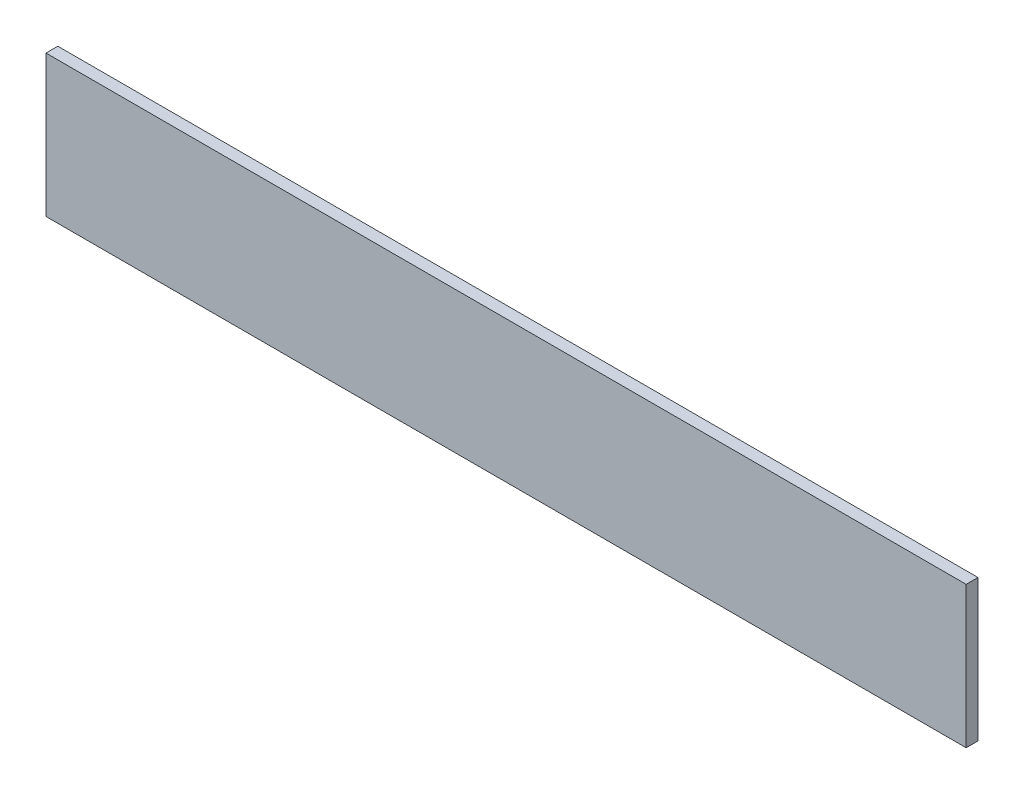
ISO-10303-21;
HEADER;
FILE_DESCRIPTION(('STEP AP214'),'2;1');
FILE_NAME('part.step','',(''),(''),'','','');
FILE_SCHEMA(('AUTOMOTIVE_DESIGN { 1 0 10303 214 1 1 1 1 }'));
ENDSEC;
DATA;
#1=APPLICATION_CONTEXT('core data for automotive mechanical design processes');
#2=APPLICATION_PROTOCOL_DEFINITION('international standard','automotive_design',2000,#1);
#3=PRODUCT_CONTEXT('',#1,'mechanical');
#4=PRODUCT('Part','Part','',(#3));
#5=PRODUCT_RELATED_PRODUCT_CATEGORY('part','',(#4));
#6=PRODUCT_DEFINITION_FORMATION('','',#4);
#7=PRODUCT_DEFINITION_CONTEXT('part definition',#1,'design');
#8=PRODUCT_DEFINITION('design','',#6,#7);
#9=PRODUCT_DEFINITION_SHAPE('','',#8);
#10=(LENGTH_UNIT() NAMED_UNIT(*) SI_UNIT(.MILLI.,.METRE.));
#11=(NAMED_UNIT(*) PLANE_ANGLE_UNIT() SI_UNIT($,.RADIAN.));
#12=(NAMED_UNIT(*) SI_UNIT($,.STERADIAN.) SOLID_ANGLE_UNIT());
#13=UNCERTAINTY_MEASURE_WITH_UNIT(LENGTH_MEASURE(1.E-05),#10,'distance_accuracy_value','');
#14=(GEOMETRIC_REPRESENTATION_CONTEXT(3) GLOBAL_UNCERTAINTY_ASSIGNED_CONTEXT((#13)) GLOBAL_UNIT_ASSIGNED_CONTEXT((#10,
#11,#12)) REPRESENTATION_CONTEXT('',''));
#15=CARTESIAN_POINT('',(0.,0.,0.));
#16=DIRECTION('',(0.,0.,1.));
#17=DIRECTION('',(1.,0.,0.));
#18=AXIS2_PLACEMENT_3D('',#15,#16,#17);
#19=CARTESIAN_POINT('',(1.1006089778178,1.5391048737361,1.7496000059366));
#20=DIRECTION('',(0.,1.,0.));
#21=DIRECTION('',(0.,0.,1.));
#22=AXIS2_PLACEMENT_3D('',#19,#20,#21);
#23=PLANE('',#22);
#24=DIRECTION('',(0.,0.,1.));
#25=VECTOR('',#24,1.);
#26=CARTESIAN_POINT('',(1.0850641795163,1.5391048737361,1.7492000059366));
#27=LINE('',#26,#25);
#28=CARTESIAN_POINT('',(1.0850641795163,1.5391048737361,1.7492000059366));
#29=VERTEX_POINT('',#28);
#30=CARTESIAN_POINT('',(1.0850641795163,1.5391048737361,1.7496000059366));
#31=VERTEX_POINT('',#30);
#32=EDGE_CURVE('E11',#29,#31,#27,.T.);
#33=ORIENTED_EDGE('',*,*,#32,.T.);
#34=DIRECTION('',(1.,0.,0.));
#35=VECTOR('',#34,1.);
#36=CARTESIAN_POINT('',(1.0850641795163,1.5391048737361,1.7496000059366));
#37=LINE('',#36,#35);
#38=CARTESIAN_POINT('',(1.1161537761193,1.5391048737361,1.7496000059366));
#39=VERTEX_POINT('',#38);
#40=EDGE_CURVE('E24',#31,#39,#37,.T.);
#41=ORIENTED_EDGE('',*,*,#40,.T.);
#42=DIRECTION('',(0.,0.,1.));
#43=VECTOR('',#42,1.);
#44=CARTESIAN_POINT('',(1.1161537761193,1.5391048737361,1.7492000059366));
#45=LINE('',#44,#43);
#46=CARTESIAN_POINT('',(1.1161537761193,1.5391048737361,1.7492000059366));
#47=VERTEX_POINT('',#46);
#48=EDGE_CURVE('E85',#47,#39,#45,.T.);
#49=ORIENTED_EDGE('',*,*,#48,.F.);
#50=DIRECTION('',(1.,0.,0.));
#51=VECTOR('',#50,1.);
#52=CARTESIAN_POINT('',(1.0850641795163,1.5391048737361,1.7492000059366));
#53=LINE('',#52,#51);
#54=EDGE_CURVE('E83',#29,#47,#53,.T.);
#55=ORIENTED_EDGE('',*,*,#54,.F.);
#56=EDGE_LOOP('',(#33,#41,#49,#55));
#57=FACE_BOUND('',#56,.T.);
#58=ADVANCED_FACE('F17',(#57),#23,.T.);
#59=CARTESIAN_POINT('',(1.1161537761193,1.5367133663051,1.7496000059366));
#60=DIRECTION('',(1.,0.,0.));
#61=DIRECTION('',(0.,0.,-1.));
#62=AXIS2_PLACEMENT_3D('',#59,#60,#61);
#63=PLANE('',#62);
#64=ORIENTED_EDGE('',*,*,#48,.T.);
#65=DIRECTION('',(0.,-1.,0.));
#66=VECTOR('',#65,1.);
#67=CARTESIAN_POINT('',(1.1161537761193,1.5391048737361,1.7496000059366));
#68=LINE('',#67,#66);
#69=CARTESIAN_POINT('',(1.1161537761193,1.5343218588741,1.7496000059366));
#70=VERTEX_POINT('',#69);
#71=EDGE_CURVE('E81',#39,#70,#68,.T.);
#72=ORIENTED_EDGE('',*,*,#71,.T.);
#73=DIRECTION('',(0.,0.,1.));
#74=VECTOR('',#73,1.);
#75=CARTESIAN_POINT('',(1.1161537761193,1.5343218588741,1.7492000059366));
#76=LINE('',#75,#74);
#77=CARTESIAN_POINT('',(1.1161537761193,1.5343218588741,1.7492000059366));
#78=VERTEX_POINT('',#77);
#79=EDGE_CURVE('E79',#78,#70,#76,.T.);
#80=ORIENTED_EDGE('',*,*,#79,.F.);
#81=DIRECTION('',(0.,-1.,0.));
#82=VECTOR('',#81,1.);
#83=CARTESIAN_POINT('',(1.1161537761193,1.5391048737361,1.7492000059366));
#84=LINE('',#83,#82);
#85=EDGE_CURVE('E70',#47,#78,#84,.T.);
#86=ORIENTED_EDGE('',*,*,#85,.F.);
#87=EDGE_LOOP('',(#64,#72,#80,#86));
#88=FACE_BOUND('',#87,.T.);
#89=ADVANCED_FACE('F90',(#88),#63,.T.);
#90=CARTESIAN_POINT('',(1.1006089778178,1.5343218588741,1.7496000059366));
#91=DIRECTION('',(0.,-1.,0.));
#92=DIRECTION('',(0.,0.,-1.));
#93=AXIS2_PLACEMENT_3D('',#90,#91,#92);
#94=PLANE('',#93);
#95=ORIENTED_EDGE('',*,*,#79,.T.);
#96=DIRECTION('',(-1.,0.,0.));
#97=VECTOR('',#96,1.);
#98=CARTESIAN_POINT('',(1.1161537761193,1.5343218588741,1.7496000059366));
#99=LINE('',#98,#97);
#100=CARTESIAN_POINT('',(1.0850641795163,1.5343218588741,1.7496000059366));
#101=VERTEX_POINT('',#100);
#102=EDGE_CURVE('E60',#70,#101,#99,.T.);
#103=ORIENTED_EDGE('',*,*,#102,.T.);
#104=DIRECTION('',(0.,0.,1.));
#105=VECTOR('',#104,1.);
#106=CARTESIAN_POINT('',(1.0850641795163,1.5343218588741,1.7492000059366));
#107=LINE('',#106,#105);
#108=CARTESIAN_POINT('',(1.0850641795163,1.5343218588741,1.7492000059366));
#109=VERTEX_POINT('',#108);
#110=EDGE_CURVE('E54',#109,#101,#107,.T.);
#111=ORIENTED_EDGE('',*,*,#110,.F.);
#112=DIRECTION('',(-1.,0.,0.));
#113=VECTOR('',#112,1.);
#114=CARTESIAN_POINT('',(1.1161537761193,1.5343218588741,1.7492000059366));
#115=LINE('',#114,#113);
#116=EDGE_CURVE('E58',#78,#109,#115,.T.);
#117=ORIENTED_EDGE('',*,*,#116,.F.);
#118=EDGE_LOOP('',(#95,#103,#111,#117));
#119=FACE_BOUND('',#118,.T.);
#120=ADVANCED_FACE('F57',(#119),#94,.T.);
#121=CARTESIAN_POINT('',(1.0850641795163,1.5367133663051,1.7496000059366));
#122=DIRECTION('',(-1.,0.,0.));
#123=DIRECTION('',(0.,0.,1.));
#124=AXIS2_PLACEMENT_3D('',#121,#122,#123);
#125=PLANE('',#124);
#126=ORIENTED_EDGE('',*,*,#110,.T.);
#127=DIRECTION('',(0.,1.,0.));
#128=VECTOR('',#127,1.);
#129=CARTESIAN_POINT('',(1.0850641795163,1.5343218588741,1.7496000059366));
#130=LINE('',#129,#128);
#131=EDGE_CURVE('E71',#101,#31,#130,.T.);
#132=ORIENTED_EDGE('',*,*,#131,.T.);
#133=ORIENTED_EDGE('',*,*,#32,.F.);
#134=DIRECTION('',(0.,1.,0.));
#135=VECTOR('',#134,1.);
#136=CARTESIAN_POINT('',(1.0850641795163,1.5343218588741,1.7492000059366));
#137=LINE('',#136,#135);
#138=EDGE_CURVE('E68',#109,#29,#137,.T.);
#139=ORIENTED_EDGE('',*,*,#138,.F.);
#140=EDGE_LOOP('',(#126,#132,#133,#139));
#141=FACE_BOUND('',#140,.T.);
#142=ADVANCED_FACE('F73',(#141),#125,.T.);
#143=CARTESIAN_POINT('',(1.0850641795163,1.5367133663051,1.7492000059366));
#144=DIRECTION('',(0.,0.,-1.));
#145=DIRECTION('',(-1.,0.,0.));
#146=AXIS2_PLACEMENT_3D('',#143,#144,#145);
#147=PLANE('',#146);
#148=ORIENTED_EDGE('',*,*,#54,.T.);
#149=ORIENTED_EDGE('',*,*,#85,.T.);
#150=ORIENTED_EDGE('',*,*,#116,.T.);
#151=ORIENTED_EDGE('',*,*,#138,.T.);
#152=EDGE_LOOP('',(#148,#149,#150,#151));
#153=FACE_BOUND('',#152,.T.);
#154=ADVANCED_FACE('F67',(#153),#147,.T.);
#155=CARTESIAN_POINT('',(1.0850641795163,1.5367133663051,1.7496000059366));
#156=DIRECTION('',(0.,0.,-1.));
#157=DIRECTION('',(-1.,0.,0.));
#158=AXIS2_PLACEMENT_3D('',#155,#156,#157);
#159=PLANE('',#158);
#160=ORIENTED_EDGE('',*,*,#40,.F.);
#161=ORIENTED_EDGE('',*,*,#131,.F.);
#162=ORIENTED_EDGE('',*,*,#102,.F.);
#163=ORIENTED_EDGE('',*,*,#71,.F.);
#164=EDGE_LOOP('',(#160,#161,#162,#163));
#165=FACE_BOUND('',#164,.T.);
#166=ADVANCED_FACE('F91',(#165),#159,.F.);
#167=CLOSED_SHELL('',(#58,#89,#120,#142,#154,#166));
#168=MANIFOLD_SOLID_BREP('B1',#167);
#169=ADVANCED_BREP_SHAPE_REPRESENTATION('',(#18,#168),#14);
#170=SHAPE_DEFINITION_REPRESENTATION(#9,#169);
ENDSEC;
END-ISO-10303-21;
